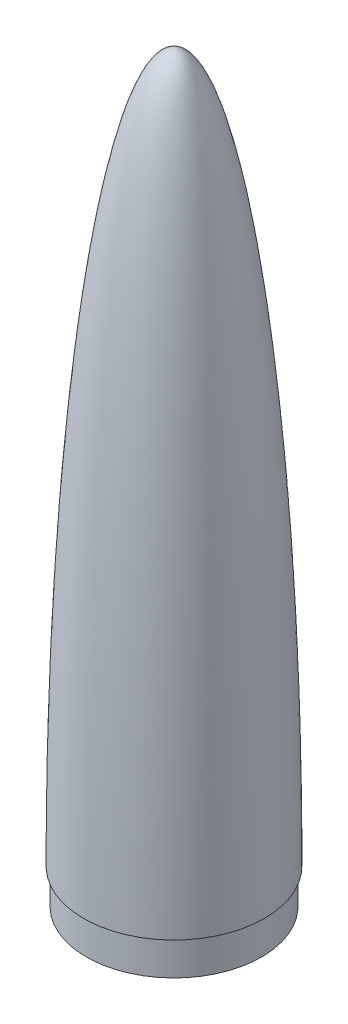
ISO-10303-21;
HEADER;
FILE_DESCRIPTION(('STEP AP214'),'2;1');
FILE_NAME('part.step','',(''),(''),'','','');
FILE_SCHEMA(('AUTOMOTIVE_DESIGN { 1 0 10303 214 1 1 1 1 }'));
ENDSEC;
DATA;
#1=APPLICATION_CONTEXT('core data for automotive mechanical design processes');
#2=APPLICATION_PROTOCOL_DEFINITION('international standard','automotive_design',2000,#1);
#3=PRODUCT_CONTEXT('',#1,'mechanical');
#4=PRODUCT('Part','Part','',(#3));
#5=PRODUCT_RELATED_PRODUCT_CATEGORY('part','',(#4));
#6=PRODUCT_DEFINITION_FORMATION('','',#4);
#7=PRODUCT_DEFINITION_CONTEXT('part definition',#1,'design');
#8=PRODUCT_DEFINITION('design','',#6,#7);
#9=PRODUCT_DEFINITION_SHAPE('','',#8);
#10=(LENGTH_UNIT() NAMED_UNIT(*) SI_UNIT(.MILLI.,.METRE.));
#11=(NAMED_UNIT(*) PLANE_ANGLE_UNIT() SI_UNIT($,.RADIAN.));
#12=(NAMED_UNIT(*) SI_UNIT($,.STERADIAN.) SOLID_ANGLE_UNIT());
#13=UNCERTAINTY_MEASURE_WITH_UNIT(LENGTH_MEASURE(1.E-05),#10,'distance_accuracy_value','');
#14=(GEOMETRIC_REPRESENTATION_CONTEXT(3) GLOBAL_UNCERTAINTY_ASSIGNED_CONTEXT((#13)) GLOBAL_UNIT_ASSIGNED_CONTEXT((#10,
#11,#12)) REPRESENTATION_CONTEXT('',''));
#15=CARTESIAN_POINT('',(0.,0.,0.));
#16=DIRECTION('',(0.,0.,1.));
#17=DIRECTION('',(1.,0.,0.));
#18=AXIS2_PLACEMENT_3D('',#15,#16,#17);
#19=CARTESIAN_POINT('',(0.,1.50000000000002,0.));
#20=DIRECTION('',(0.,1.,0.));
#21=DIRECTION('',(0.,0.,1.));
#22=AXIS2_PLACEMENT_3D('',#19,#20,#21);
#23=CONICAL_SURFACE('',#22,36.2855179577227,0.786891827820848);
#24=CARTESIAN_POINT('',(0.,2.9981090152685,0.));
#25=DIRECTION('',(0.,1.,0.));
#26=DIRECTION('',(0.,0.,1.));
#27=AXIS2_PLACEMENT_3D('',#24,#25,#26);
#28=CIRCLE('',#27,37.7881090152684);
#29=CARTESIAN_POINT('',(0.,2.9981090152685,37.7881090152684));
#30=VERTEX_POINT('',#29);
#31=EDGE_CURVE('E81',#30,#30,#28,.T.);
#32=ORIENTED_EDGE('',*,*,#31,.F.);
#33=EDGE_LOOP('',(#32));
#34=FACE_BOUND('',#33,.T.);
#35=CARTESIAN_POINT('',(0.,1.50000000000002,0.));
#36=DIRECTION('',(0.,1.,0.));
#37=DIRECTION('',(0.,0.,1.));
#38=AXIS2_PLACEMENT_3D('',#35,#36,#37);
#39=CIRCLE('',#38,36.2855179577227);
#40=CARTESIAN_POINT('',(0.,1.50000000000002,36.2855179577227));
#41=VERTEX_POINT('',#40);
#42=EDGE_CURVE('E11',#41,#41,#39,.T.);
#43=ORIENTED_EDGE('',*,*,#42,.T.);
#44=EDGE_LOOP('',(#43));
#45=FACE_BOUND('',#44,.T.);
#46=ADVANCED_FACE('F54',(#34,#45),#23,.T.);
#47=CARTESIAN_POINT('',(36.2855179577227,1.50000000000002,0.));
#48=DIRECTION('',(0.,1.,0.));
#49=DIRECTION('',(0.,0.,1.));
#50=AXIS2_PLACEMENT_3D('',#47,#48,#49);
#51=PLANE('',#50);
#52=CARTESIAN_POINT('',(-14.,1.50000000000002,30.));
#53=DIRECTION('',(0.,-1.,0.));
#54=DIRECTION('',(0.,0.,-1.));
#55=AXIS2_PLACEMENT_3D('',#52,#53,#54);
#56=CIRCLE('',#55,1.6);
#57=CARTESIAN_POINT('',(-14.,1.50000000000002,28.4));
#58=VERTEX_POINT('',#57);
#59=EDGE_CURVE('E74',#58,#58,#56,.T.);
#60=ORIENTED_EDGE('',*,*,#59,.F.);
#61=EDGE_LOOP('',(#60));
#62=FACE_BOUND('',#61,.T.);
#63=CARTESIAN_POINT('',(14.,1.50000000000002,30.));
#64=DIRECTION('',(0.,-1.,0.));
#65=DIRECTION('',(0.,0.,-1.));
#66=AXIS2_PLACEMENT_3D('',#63,#64,#65);
#67=CIRCLE('',#66,1.6);
#68=CARTESIAN_POINT('',(14.,1.50000000000002,28.4));
#69=VERTEX_POINT('',#68);
#70=EDGE_CURVE('E96',#69,#69,#67,.T.);
#71=ORIENTED_EDGE('',*,*,#70,.F.);
#72=EDGE_LOOP('',(#71));
#73=FACE_BOUND('',#72,.T.);
#74=CARTESIAN_POINT('',(14.,1.50000000000002,-30.));
#75=DIRECTION('',(0.,-1.,0.));
#76=DIRECTION('',(0.,0.,1.));
#77=AXIS2_PLACEMENT_3D('',#74,#75,#76);
#78=CIRCLE('',#77,1.6);
#79=CARTESIAN_POINT('',(14.,1.50000000000002,-28.4));
#80=VERTEX_POINT('',#79);
#81=EDGE_CURVE('E93',#80,#80,#78,.T.);
#82=ORIENTED_EDGE('',*,*,#81,.F.);
#83=EDGE_LOOP('',(#82));
#84=FACE_BOUND('',#83,.T.);
#85=CARTESIAN_POINT('',(-14.,1.50000000000002,-30.));
#86=DIRECTION('',(0.,-1.,0.));
#87=DIRECTION('',(0.,0.,1.));
#88=AXIS2_PLACEMENT_3D('',#85,#86,#87);
#89=CIRCLE('',#88,1.6);
#90=CARTESIAN_POINT('',(-14.,1.50000000000002,-28.4));
#91=VERTEX_POINT('',#90);
#92=EDGE_CURVE('E90',#91,#91,#89,.T.);
#93=ORIENTED_EDGE('',*,*,#92,.F.);
#94=EDGE_LOOP('',(#93));
#95=FACE_BOUND('',#94,.T.);
#96=ORIENTED_EDGE('',*,*,#42,.F.);
#97=EDGE_LOOP('',(#96));
#98=FACE_BOUND('',#97,.T.);
#99=CARTESIAN_POINT('',(0.,1.50000000000002,0.));
#100=DIRECTION('',(0.,1.,0.));
#101=DIRECTION('',(0.,0.,1.));
#102=AXIS2_PLACEMENT_3D('',#99,#100,#101);
#103=CIRCLE('',#102,31.2881090152684);
#104=CARTESIAN_POINT('',(0.,1.50000000000002,31.2881090152684));
#105=VERTEX_POINT('',#104);
#106=EDGE_CURVE('E61',#105,#105,#103,.T.);
#107=ORIENTED_EDGE('',*,*,#106,.T.);
#108=EDGE_LOOP('',(#107));
#109=FACE_BOUND('',#108,.T.);
#110=ADVANCED_FACE('F105',(#62,#73,#84,#95,#98,#109),#51,.F.);
#111=CARTESIAN_POINT('',(0.,0.,0.));
#112=DIRECTION('',(0.,1.,0.));
#113=DIRECTION('',(0.,0.,1.));
#114=AXIS2_PLACEMENT_3D('',#111,#112,#113);
#115=CYLINDRICAL_SURFACE('',#114,31.2881090152684);
#116=ORIENTED_EDGE('',*,*,#106,.F.);
#117=EDGE_LOOP('',(#116));
#118=FACE_BOUND('',#117,.T.);
#119=CARTESIAN_POINT('',(0.,2.9981090152685,0.));
#120=DIRECTION('',(0.,1.,0.));
#121=DIRECTION('',(0.,0.,1.));
#122=AXIS2_PLACEMENT_3D('',#119,#120,#121);
#123=CIRCLE('',#122,31.2881090152684);
#124=CARTESIAN_POINT('',(0.,2.9981090152685,31.2881090152684));
#125=VERTEX_POINT('',#124);
#126=EDGE_CURVE('E66',#125,#125,#123,.T.);
#127=ORIENTED_EDGE('',*,*,#126,.T.);
#128=EDGE_LOOP('',(#127));
#129=FACE_BOUND('',#128,.T.);
#130=ADVANCED_FACE('F108',(#118,#129),#115,.F.);
#131=CARTESIAN_POINT('',(31.2881090152684,2.9981090152685,0.));
#132=DIRECTION('',(0.,-1.,0.));
#133=DIRECTION('',(0.,0.,-1.));
#134=AXIS2_PLACEMENT_3D('',#131,#132,#133);
#135=PLANE('',#134);
#136=CARTESIAN_POINT('',(-14.,2.9981090152685,30.));
#137=DIRECTION('',(0.,-1.,0.));
#138=DIRECTION('',(0.,0.,-1.));
#139=AXIS2_PLACEMENT_3D('',#136,#137,#138);
#140=CIRCLE('',#139,1.6);
#141=CARTESIAN_POINT('',(-14.,2.9981090152685,28.4));
#142=VERTEX_POINT('',#141);
#143=EDGE_CURVE('E57',#142,#142,#140,.T.);
#144=ORIENTED_EDGE('',*,*,#143,.T.);
#145=EDGE_LOOP('',(#144));
#146=FACE_BOUND('',#145,.T.);
#147=CARTESIAN_POINT('',(14.,2.9981090152685,30.));
#148=DIRECTION('',(0.,-1.,0.));
#149=DIRECTION('',(0.,0.,-1.));
#150=AXIS2_PLACEMENT_3D('',#147,#148,#149);
#151=CIRCLE('',#150,1.6);
#152=CARTESIAN_POINT('',(14.,2.9981090152685,28.4));
#153=VERTEX_POINT('',#152);
#154=EDGE_CURVE('E76',#153,#153,#151,.T.);
#155=ORIENTED_EDGE('',*,*,#154,.T.);
#156=EDGE_LOOP('',(#155));
#157=FACE_BOUND('',#156,.T.);
#158=CARTESIAN_POINT('',(14.,2.9981090152685,-30.));
#159=DIRECTION('',(0.,-1.,0.));
#160=DIRECTION('',(0.,0.,-1.));
#161=AXIS2_PLACEMENT_3D('',#158,#159,#160);
#162=CIRCLE('',#161,1.6);
#163=CARTESIAN_POINT('',(14.,2.9981090152685,-31.6));
#164=VERTEX_POINT('',#163);
#165=EDGE_CURVE('E73',#164,#164,#162,.T.);
#166=ORIENTED_EDGE('',*,*,#165,.T.);
#167=EDGE_LOOP('',(#166));
#168=FACE_BOUND('',#167,.T.);
#169=CARTESIAN_POINT('',(-14.,2.9981090152685,-30.));
#170=DIRECTION('',(0.,-1.,0.));
#171=DIRECTION('',(0.,0.,-1.));
#172=AXIS2_PLACEMENT_3D('',#169,#170,#171);
#173=CIRCLE('',#172,1.6);
#174=CARTESIAN_POINT('',(-14.,2.9981090152685,-31.6));
#175=VERTEX_POINT('',#174);
#176=EDGE_CURVE('E70',#175,#175,#173,.T.);
#177=ORIENTED_EDGE('',*,*,#176,.T.);
#178=EDGE_LOOP('',(#177));
#179=FACE_BOUND('',#178,.T.);
#180=ORIENTED_EDGE('',*,*,#126,.F.);
#181=EDGE_LOOP('',(#180));
#182=FACE_BOUND('',#181,.T.);
#183=ORIENTED_EDGE('',*,*,#31,.T.);
#184=EDGE_LOOP('',(#183));
#185=FACE_BOUND('',#184,.T.);
#186=ADVANCED_FACE('F120',(#146,#157,#168,#179,#182,#185),#135,.F.);
#187=CARTESIAN_POINT('',(-14.,11.5,-30.));
#188=DIRECTION('',(0.,-1.,0.));
#189=DIRECTION('',(0.,0.,-1.));
#190=AXIS2_PLACEMENT_3D('',#187,#188,#189);
#191=CYLINDRICAL_SURFACE('',#190,1.6);
#192=ORIENTED_EDGE('',*,*,#92,.T.);
#193=EDGE_LOOP('',(#192));
#194=FACE_BOUND('',#193,.T.);
#195=ORIENTED_EDGE('',*,*,#176,.F.);
#196=EDGE_LOOP('',(#195));
#197=FACE_BOUND('',#196,.T.);
#198=ADVANCED_FACE('F125',(#194,#197),#191,.F.);
#199=CARTESIAN_POINT('',(14.,11.5,-30.));
#200=DIRECTION('',(0.,-1.,0.));
#201=DIRECTION('',(0.,0.,-1.));
#202=AXIS2_PLACEMENT_3D('',#199,#200,#201);
#203=CYLINDRICAL_SURFACE('',#202,1.6);
#204=ORIENTED_EDGE('',*,*,#81,.T.);
#205=EDGE_LOOP('',(#204));
#206=FACE_BOUND('',#205,.T.);
#207=ORIENTED_EDGE('',*,*,#165,.F.);
#208=EDGE_LOOP('',(#207));
#209=FACE_BOUND('',#208,.T.);
#210=ADVANCED_FACE('F130',(#206,#209),#203,.F.);
#211=CARTESIAN_POINT('',(14.,11.5,30.));
#212=DIRECTION('',(0.,-1.,0.));
#213=DIRECTION('',(0.,0.,-1.));
#214=AXIS2_PLACEMENT_3D('',#211,#212,#213);
#215=CYLINDRICAL_SURFACE('',#214,1.6);
#216=ORIENTED_EDGE('',*,*,#70,.T.);
#217=EDGE_LOOP('',(#216));
#218=FACE_BOUND('',#217,.T.);
#219=ORIENTED_EDGE('',*,*,#154,.F.);
#220=EDGE_LOOP('',(#219));
#221=FACE_BOUND('',#220,.T.);
#222=ADVANCED_FACE('F167',(#218,#221),#215,.F.);
#223=CARTESIAN_POINT('',(-14.,11.5,30.));
#224=DIRECTION('',(0.,-1.,0.));
#225=DIRECTION('',(0.,0.,-1.));
#226=AXIS2_PLACEMENT_3D('',#223,#224,#225);
#227=CYLINDRICAL_SURFACE('',#226,1.6);
#228=ORIENTED_EDGE('',*,*,#59,.T.);
#229=EDGE_LOOP('',(#228));
#230=FACE_BOUND('',#229,.T.);
#231=ORIENTED_EDGE('',*,*,#143,.F.);
#232=EDGE_LOOP('',(#231));
#233=FACE_BOUND('',#232,.T.);
#234=ADVANCED_FACE('F102',(#230,#233),#227,.F.);
#235=CLOSED_SHELL('',(#46,#110,#130,#186,#198,#210,#222,#234));
#236=MANIFOLD_SOLID_BREP('B2',#235);
#237=CARTESIAN_POINT('',(0.,0.,0.));
#238=DIRECTION('',(0.,1.,0.));
#239=DIRECTION('',(-1.,0.,0.));
#240=AXIS2_PLACEMENT_3D('',#237,#238,#239);
#241=PLANE('',#240);
#242=CARTESIAN_POINT('',(0.,0.,0.));
#243=DIRECTION('',(0.,-1.,0.));
#244=DIRECTION('',(1.,0.,0.));
#245=AXIS2_PLACEMENT_3D('',#242,#243,#244);
#246=CIRCLE('',#245,37.79);
#247=CARTESIAN_POINT('',(37.79,0.,0.));
#248=VERTEX_POINT('',#247);
#249=EDGE_CURVE('E52',#248,#248,#246,.T.);
#250=ORIENTED_EDGE('',*,*,#249,.F.);
#251=EDGE_LOOP('',(#250));
#252=FACE_BOUND('',#251,.T.);
#253=CARTESIAN_POINT('',(0.,0.,0.));
#254=DIRECTION('',(0.,-1.,0.));
#255=DIRECTION('',(1.,0.,0.));
#256=AXIS2_PLACEMENT_3D('',#253,#254,#255);
#257=CIRCLE('',#256,38.99);
#258=CARTESIAN_POINT('',(38.99,0.,0.));
#259=VERTEX_POINT('',#258);
#260=EDGE_CURVE('E210',#259,#259,#257,.T.);
#261=ORIENTED_EDGE('',*,*,#260,.T.);
#262=EDGE_LOOP('',(#261));
#263=FACE_BOUND('',#262,.T.);
#264=ADVANCED_FACE('F199',(#252,#263),#241,.F.);
#265=CARTESIAN_POINT('',(0.,0.,0.));
#266=DIRECTION('',(0.,0.,1.));
#267=DIRECTION('',(0.,1.,0.));
#268=AXIS2_PLACEMENT_3D('',#265,#266,#267);
#269=ELLIPSE('',#268,305.,38.99);
#270=TRIMMED_CURVE('',#269,(PARAMETER_VALUE(3.14159265358979)),
(PARAMETER_VALUE(6.28318530717959)),.T.,.PARAMETER.);
#271=CARTESIAN_POINT('',(0.,0.,0.));
#272=DIRECTION('',(0.,-1.,0.));
#273=AXIS1_PLACEMENT('',#271,#272);
#274=SURFACE_OF_REVOLUTION('',#270,#273);
#275=CARTESIAN_POINT('',(0.,305.,0.));
#276=VERTEX_POINT('',#275);
#277=VERTEX_LOOP('',#276);
#278=FACE_BOUND('',#277,.T.);
#279=ORIENTED_EDGE('',*,*,#260,.F.);
#280=EDGE_LOOP('',(#279));
#281=FACE_BOUND('',#280,.T.);
#282=ADVANCED_FACE('F216',(#278,#281),#274,.F.);
#283=CARTESIAN_POINT('',(0.,3.00000000000003,0.));
#284=DIRECTION('',(0.,1.,0.));
#285=DIRECTION('',(0.,0.,1.));
#286=AXIS2_PLACEMENT_3D('',#283,#284,#285);
#287=CONICAL_SURFACE('',#286,37.79,0.785398163397446);
#288=CARTESIAN_POINT('',(0.,1.50000000000002,0.));
#289=DIRECTION('',(0.,-1.,0.));
#290=DIRECTION('',(0.,0.,-1.));
#291=AXIS2_PLACEMENT_3D('',#288,#289,#290);
#292=CIRCLE('',#291,36.29);
#293=CARTESIAN_POINT('',(0.,1.50000000000002,-36.29));
#294=VERTEX_POINT('',#293);
#295=EDGE_CURVE('E269',#294,#294,#292,.T.);
#296=ORIENTED_EDGE('',*,*,#295,.T.);
#297=EDGE_LOOP('',(#296));
#298=FACE_BOUND('',#297,.T.);
#299=CARTESIAN_POINT('',(0.,2.9981090152685,0.));
#300=DIRECTION('',(0.,-1.,0.));
#301=DIRECTION('',(1.,0.,0.));
#302=AXIS2_PLACEMENT_3D('',#299,#300,#301);
#303=CIRCLE('',#302,37.7881090152684);
#304=CARTESIAN_POINT('',(37.7881090152684,2.9981090152685,0.));
#305=VERTEX_POINT('',#304);
#306=EDGE_CURVE('E204',#305,#305,#303,.T.);
#307=ORIENTED_EDGE('',*,*,#306,.F.);
#308=EDGE_LOOP('',(#307));
#309=FACE_BOUND('',#308,.T.);
#310=ADVANCED_FACE('F219',(#298,#309),#287,.F.);
#311=CARTESIAN_POINT('',(0.,0.,0.));
#312=DIRECTION('',(0.,-1.,0.));
#313=DIRECTION('',(0.,0.,-1.));
#314=AXIS2_PLACEMENT_3D('',#311,#312,#313);
#315=CYLINDRICAL_SURFACE('',#314,37.79);
#316=CARTESIAN_POINT('',(0.,-15.,0.));
#317=DIRECTION('',(0.,-1.,0.));
#318=DIRECTION('',(0.,0.,-1.));
#319=AXIS2_PLACEMENT_3D('',#316,#317,#318);
#320=CIRCLE('',#319,37.79);
#321=CARTESIAN_POINT('',(0.,-15.,-37.79));
#322=VERTEX_POINT('',#321);
#323=EDGE_CURVE('E228',#322,#322,#320,.T.);
#324=ORIENTED_EDGE('',*,*,#323,.F.);
#325=EDGE_LOOP('',(#324));
#326=FACE_BOUND('',#325,.T.);
#327=ORIENTED_EDGE('',*,*,#249,.T.);
#328=EDGE_LOOP('',(#327));
#329=FACE_BOUND('',#328,.T.);
#330=ADVANCED_FACE('F244',(#326,#329),#315,.T.);
#331=CARTESIAN_POINT('',(37.79,-15.,0.));
#332=DIRECTION('',(0.,-1.,0.));
#333=DIRECTION('',(0.,0.,-1.));
#334=AXIS2_PLACEMENT_3D('',#331,#332,#333);
#335=PLANE('',#334);
#336=ORIENTED_EDGE('',*,*,#323,.T.);
#337=EDGE_LOOP('',(#336));
#338=FACE_BOUND('',#337,.T.);
#339=CARTESIAN_POINT('',(0.,-15.,0.));
#340=DIRECTION('',(0.,-1.,0.));
#341=DIRECTION('',(0.,0.,-1.));
#342=AXIS2_PLACEMENT_3D('',#339,#340,#341);
#343=CIRCLE('',#342,36.29);
#344=CARTESIAN_POINT('',(0.,-15.,-36.29));
#345=VERTEX_POINT('',#344);
#346=EDGE_CURVE('E266',#345,#345,#343,.T.);
#347=ORIENTED_EDGE('',*,*,#346,.F.);
#348=EDGE_LOOP('',(#347));
#349=FACE_BOUND('',#348,.T.);
#350=ADVANCED_FACE('F236',(#338,#349),#335,.T.);
#351=CARTESIAN_POINT('',(0.,0.,0.));
#352=DIRECTION('',(0.,-1.,0.));
#353=DIRECTION('',(0.,0.,-1.));
#354=AXIS2_PLACEMENT_3D('',#351,#352,#353);
#355=CYLINDRICAL_SURFACE('',#354,36.29);
#356=ORIENTED_EDGE('',*,*,#346,.T.);
#357=EDGE_LOOP('',(#356));
#358=FACE_BOUND('',#357,.T.);
#359=ORIENTED_EDGE('',*,*,#295,.F.);
#360=EDGE_LOOP('',(#359));
#361=FACE_BOUND('',#360,.T.);
#362=ADVANCED_FACE('F252',(#358,#361),#355,.F.);
#363=CARTESIAN_POINT('',(37.79,0.,0.));
#364=CARTESIAN_POINT('',(37.79,9.96023644432431,0.));
#365=CARTESIAN_POINT('',(37.6646944416075,29.9355725462488,0.));
#366=CARTESIAN_POINT('',(37.1026550416885,59.5658619842099,0.));
#367=CARTESIAN_POINT('',(36.1719204923581,88.6332451117315,0.));
#368=CARTESIAN_POINT('',(34.4516167057034,126.2464121439,0.));
#369=CARTESIAN_POINT('',(31.4319735214777,170.440975847829,0.));
#370=CARTESIAN_POINT('',(26.5566848436871,216.909350239995,0.));
#371=CARTESIAN_POINT('',(21.6094204080246,248.663260812449,0.));
#372=CARTESIAN_POINT('',(17.240887319488,269.142472583423,0.));
#373=CARTESIAN_POINT('',(13.7952020720237,281.888207179951,0.));
#374=CARTESIAN_POINT('',(10.2234610323318,291.880973095913,0.));
#375=CARTESIAN_POINT('',(7.19161539353613,297.807361864009,0.));
#376=CARTESIAN_POINT('',(4.80162206307366,301.04274795178,0.));
#377=CARTESIAN_POINT('',(3.07144677578734,302.705487016752,0.));
#378=CARTESIAN_POINT('',(1.44843264571311,303.619825672567,0.));
#379=CARTESIAN_POINT('',(0.503435410311526,303.8,0.));
#380=CARTESIAN_POINT('',(0.,303.8,0.));
#381=B_SPLINE_CURVE_WITH_KNOTS('',3,(#363,#364,#365,#366,#367,#368,#369,#370,#371,#372,#373,
#374,#375,#376,#377,#378,#379,#380),.UNSPECIFIED.,.F.,.F.,(4,1,1,1,1,1,1,1,1,1,1,1,1,1,1,4),
(-1.5707963267949,-1.47262155637022,-1.37444678594553,-1.27627201552085,-1.17809724509617,
-0.98174770424681,-0.785398163397448,-0.589048622548086,-0.490873852123405,-0.392699081698724,
-0.294524311274043,-0.196349540849362,-0.147262155637022,-0.098174770424681,-0.0490873852123405,
0.),.UNSPECIFIED.);
#382=CARTESIAN_POINT('',(0.,0.,0.));
#383=DIRECTION('',(0.,-1.,0.));
#384=AXIS1_PLACEMENT('',#382,#383);
#385=SURFACE_OF_REVOLUTION('',#381,#384);
#386=ORIENTED_EDGE('',*,*,#306,.T.);
#387=EDGE_LOOP('',(#386));
#388=FACE_BOUND('',#387,.T.);
#389=CARTESIAN_POINT('',(0.,303.8,0.));
#390=VERTEX_POINT('',#389);
#391=VERTEX_LOOP('',#390);
#392=FACE_BOUND('',#391,.T.);
#393=ADVANCED_FACE('F201',(#388,#392),#385,.T.);
#394=CLOSED_SHELL('',(#264,#282,#310,#330,#350,#362,#393));
#395=MANIFOLD_SOLID_BREP('B6',#394);
#396=ADVANCED_BREP_SHAPE_REPRESENTATION('',(#18,#236,#395),#14);
#397=SHAPE_DEFINITION_REPRESENTATION(#9,#396);
ENDSEC;
END-ISO-10303-21;
